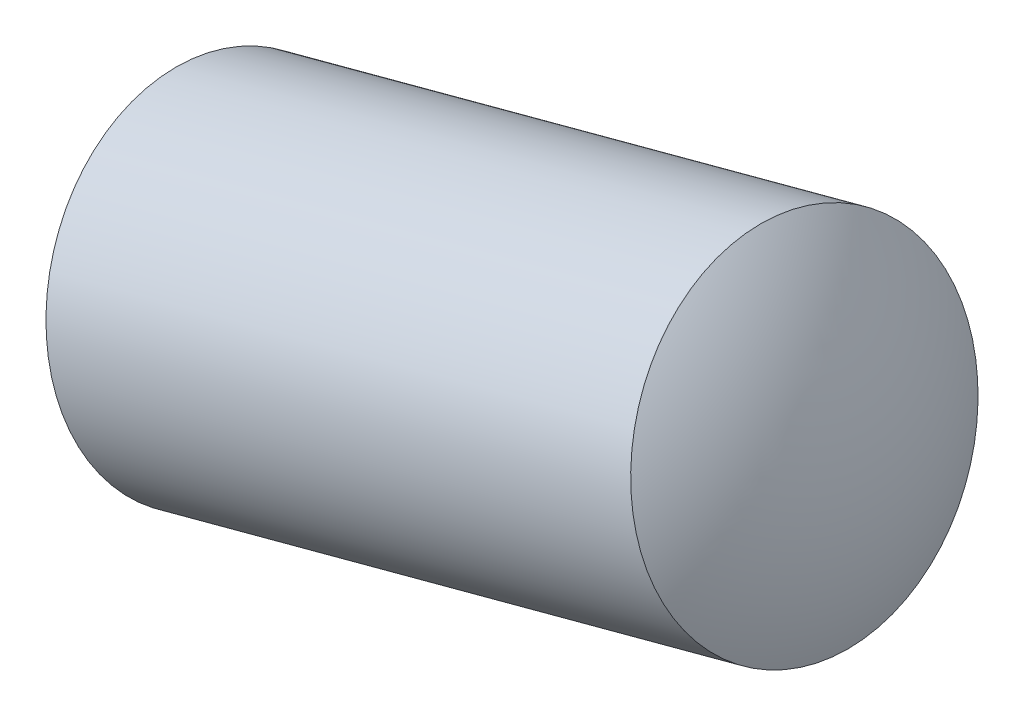
ISO-10303-21;
HEADER;
FILE_DESCRIPTION(('STEP AP214'),'2;1');
FILE_NAME('part.step','',(''),(''),'','','');
FILE_SCHEMA(('AUTOMOTIVE_DESIGN { 1 0 10303 214 1 1 1 1 }'));
ENDSEC;
DATA;
#1=APPLICATION_CONTEXT('core data for automotive mechanical design processes');
#2=APPLICATION_PROTOCOL_DEFINITION('international standard','automotive_design',2000,#1);
#3=PRODUCT_CONTEXT('',#1,'mechanical');
#4=PRODUCT('Part','Part','',(#3));
#5=PRODUCT_RELATED_PRODUCT_CATEGORY('part','',(#4));
#6=PRODUCT_DEFINITION_FORMATION('','',#4);
#7=PRODUCT_DEFINITION_CONTEXT('part definition',#1,'design');
#8=PRODUCT_DEFINITION('design','',#6,#7);
#9=PRODUCT_DEFINITION_SHAPE('','',#8);
#10=(LENGTH_UNIT() NAMED_UNIT(*) SI_UNIT(.MILLI.,.METRE.));
#11=(NAMED_UNIT(*) PLANE_ANGLE_UNIT() SI_UNIT($,.RADIAN.));
#12=(NAMED_UNIT(*) SI_UNIT($,.STERADIAN.) SOLID_ANGLE_UNIT());
#13=UNCERTAINTY_MEASURE_WITH_UNIT(LENGTH_MEASURE(1.E-05),#10,'distance_accuracy_value','');
#14=(GEOMETRIC_REPRESENTATION_CONTEXT(3) GLOBAL_UNCERTAINTY_ASSIGNED_CONTEXT((#13)) GLOBAL_UNIT_ASSIGNED_CONTEXT((#10,
#11,#12)) REPRESENTATION_CONTEXT('',''));
#15=CARTESIAN_POINT('',(0.,0.,0.));
#16=DIRECTION('',(0.,0.,1.));
#17=DIRECTION('',(1.,0.,0.));
#18=AXIS2_PLACEMENT_3D('',#15,#16,#17);
#19=CARTESIAN_POINT('',(-26.6614110427164,-7.14390355797012,0.9));
#20=DIRECTION('',(-0.258819045102521,0.965925826289068,0.));
#21=DIRECTION('',(-0.965925826289068,-0.258819045102521,0.));
#22=AXIS2_PLACEMENT_3D('',#19,#20,#21);
#23=SPHERICAL_SURFACE('',#22,3.);
#24=CARTESIAN_POINT('',(-26.6614110427164,-7.14390355797012,0.9));
#25=DIRECTION('',(0.965925826289068,0.258819045102521,0.));
#26=DIRECTION('',(0.,0.,-1.));
#27=AXIS2_PLACEMENT_3D('',#24,#25,#26);
#28=SPHERICAL_SURFACE('',#27,3.);
#29=CARTESIAN_POINT('',(-29.1709599539299,-7.81633516209612,0.9));
#30=DIRECTION('',(0.965925826289068,0.258819045102521,0.));
#31=DIRECTION('',(0.,0.,-1.));
#32=AXIS2_PLACEMENT_3D('',#29,#30,#31);
#33=CIRCLE('',#32,1.5);
#34=CARTESIAN_POINT('',(-29.1709599539299,-7.81633516209612,-0.6));
#35=VERTEX_POINT('',#34);
#36=EDGE_CURVE('E11',#35,#35,#33,.T.);
#37=ORIENTED_EDGE('',*,*,#36,.F.);
#38=EDGE_LOOP('',(#37));
#39=FACE_BOUND('',#38,.T.);
#40=ADVANCED_FACE('F17',(#39),#28,.T.);
#41=CARTESIAN_POINT('',(-26.4645094031823,-7.09114392266852,0.9));
#42=DIRECTION('',(-0.258819045102521,0.965925826289068,0.));
#43=DIRECTION('',(0.965925826289068,0.258819045102521,0.));
#44=AXIS2_PLACEMENT_3D('',#41,#42,#43);
#45=SPHERICAL_SURFACE('',#44,3.);
#46=CARTESIAN_POINT('',(-26.4645094031823,-7.09114392266852,0.9));
#47=DIRECTION('',(0.965925826289068,0.258819045102521,0.));
#48=DIRECTION('',(0.,0.,-1.));
#49=AXIS2_PLACEMENT_3D('',#46,#47,#48);
#50=SPHERICAL_SURFACE('',#49,3.);
#51=CARTESIAN_POINT('',(-23.9549604919689,-6.41871231854252,0.9));
#52=DIRECTION('',(0.965925826289068,0.258819045102521,0.));
#53=DIRECTION('',(0.,0.,-1.));
#54=AXIS2_PLACEMENT_3D('',#51,#52,#53);
#55=CIRCLE('',#54,1.5);
#56=CARTESIAN_POINT('',(-23.9549604919689,-6.41871231854252,-0.6));
#57=VERTEX_POINT('',#56);
#58=EDGE_CURVE('E20',#57,#57,#55,.T.);
#59=ORIENTED_EDGE('',*,*,#58,.T.);
#60=EDGE_LOOP('',(#59));
#61=FACE_BOUND('',#60,.T.);
#62=ADVANCED_FACE('F39',(#61),#50,.T.);
#63=CARTESIAN_POINT('',(-25.2589603574591,-6.76811802943089,0.9));
#64=DIRECTION('',(0.965925826289068,0.258819045102521,0.));
#65=DIRECTION('',(0.,0.,-1.));
#66=AXIS2_PLACEMENT_3D('',#63,#64,#65);
#67=CYLINDRICAL_SURFACE('',#66,1.5);
#68=ORIENTED_EDGE('',*,*,#36,.T.);
#69=EDGE_LOOP('',(#68));
#70=FACE_BOUND('',#69,.T.);
#71=ORIENTED_EDGE('',*,*,#58,.F.);
#72=EDGE_LOOP('',(#71));
#73=FACE_BOUND('',#72,.T.);
#74=ADVANCED_FACE('F51',(#70,#73),#67,.T.);
#75=CLOSED_SHELL('',(#40,#62,#74));
#76=MANIFOLD_SOLID_BREP('B1',#75);
#77=ADVANCED_BREP_SHAPE_REPRESENTATION('',(#18,#76),#14);
#78=SHAPE_DEFINITION_REPRESENTATION(#9,#77);
ENDSEC;
END-ISO-10303-21;
